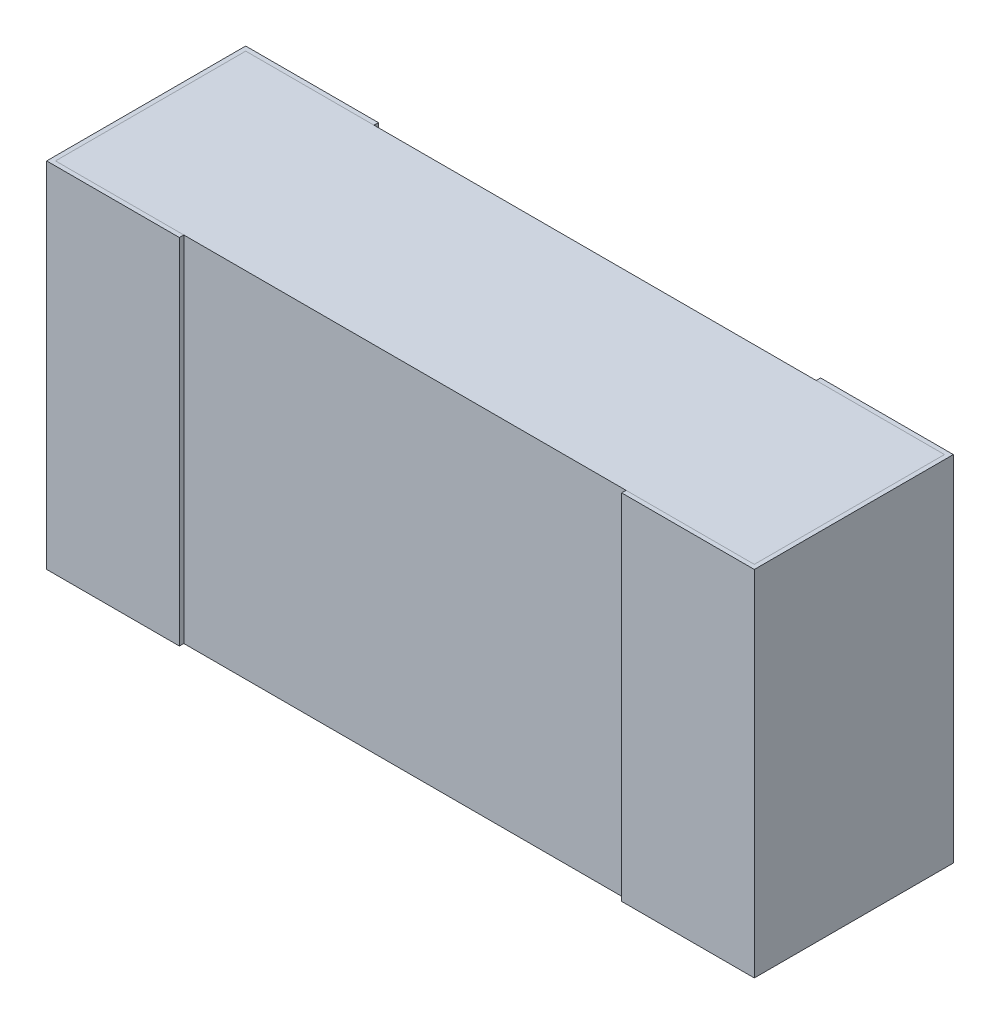
ISO-10303-21;
HEADER;
FILE_DESCRIPTION(('STEP AP214'),'2;1');
FILE_NAME('part.step','',(''),(''),'','','');
FILE_SCHEMA(('AUTOMOTIVE_DESIGN { 1 0 10303 214 1 1 1 1 }'));
ENDSEC;
DATA;
#1=APPLICATION_CONTEXT('core data for automotive mechanical design processes');
#2=APPLICATION_PROTOCOL_DEFINITION('international standard','automotive_design',2000,#1);
#3=PRODUCT_CONTEXT('',#1,'mechanical');
#4=PRODUCT('Part','Part','',(#3));
#5=PRODUCT_RELATED_PRODUCT_CATEGORY('part','',(#4));
#6=PRODUCT_DEFINITION_FORMATION('','',#4);
#7=PRODUCT_DEFINITION_CONTEXT('part definition',#1,'design');
#8=PRODUCT_DEFINITION('design','',#6,#7);
#9=PRODUCT_DEFINITION_SHAPE('','',#8);
#10=(LENGTH_UNIT() NAMED_UNIT(*) SI_UNIT(.MILLI.,.METRE.));
#11=(NAMED_UNIT(*) PLANE_ANGLE_UNIT() SI_UNIT($,.RADIAN.));
#12=(NAMED_UNIT(*) SI_UNIT($,.STERADIAN.) SOLID_ANGLE_UNIT());
#13=UNCERTAINTY_MEASURE_WITH_UNIT(LENGTH_MEASURE(1.E-05),#10,'distance_accuracy_value','');
#14=(GEOMETRIC_REPRESENTATION_CONTEXT(3) GLOBAL_UNCERTAINTY_ASSIGNED_CONTEXT((#13)) GLOBAL_UNIT_ASSIGNED_CONTEXT((#10,
#11,#12)) REPRESENTATION_CONTEXT('',''));
#15=CARTESIAN_POINT('',(0.,0.,0.));
#16=DIRECTION('',(0.,0.,1.));
#17=DIRECTION('',(1.,0.,0.));
#18=AXIS2_PLACEMENT_3D('',#15,#16,#17);
#19=CARTESIAN_POINT('',(0.79,2.03746755693052,-0.0216121610286598));
#20=DIRECTION('',(0.,0.,-1.));
#21=DIRECTION('',(-1.,0.,0.));
#22=AXIS2_PLACEMENT_3D('',#19,#20,#21);
#23=PLANE('',#22);
#24=DIRECTION('',(1.,0.,0.));
#25=VECTOR('',#24,1.);
#26=CARTESIAN_POINT('',(0.79,0.4,-0.0216121610286598));
#27=LINE('',#26,#25);
#28=CARTESIAN_POINT('',(-0.79,0.4,-0.0216121610286598));
#29=VERTEX_POINT('',#28);
#30=CARTESIAN_POINT('',(0.79,0.4,-0.0216121610286598));
#31=VERTEX_POINT('',#30);
#32=EDGE_CURVE('E111',#29,#31,#27,.T.);
#33=ORIENTED_EDGE('',*,*,#32,.F.);
#34=DIRECTION('',(0.,-1.,0.));
#35=VECTOR('',#34,1.);
#36=CARTESIAN_POINT('',(-0.79,2.03746755693052,-0.0216121610286598));
#37=LINE('',#36,#35);
#38=CARTESIAN_POINT('',(-0.79,-0.4,-0.0216121610286598));
#39=VERTEX_POINT('',#38);
#40=EDGE_CURVE('E49',#29,#39,#37,.T.);
#41=ORIENTED_EDGE('',*,*,#40,.T.);
#42=DIRECTION('',(-1.,0.,0.));
#43=VECTOR('',#42,1.);
#44=CARTESIAN_POINT('',(0.79,-0.4,-0.0216121610286598));
#45=LINE('',#44,#43);
#46=CARTESIAN_POINT('',(0.79,-0.4,-0.0216121610286598));
#47=VERTEX_POINT('',#46);
#48=EDGE_CURVE('E105',#47,#39,#45,.T.);
#49=ORIENTED_EDGE('',*,*,#48,.F.);
#50=DIRECTION('',(0.,-1.,0.));
#51=VECTOR('',#50,1.);
#52=CARTESIAN_POINT('',(0.79,2.03746755693052,-0.0216121610286598));
#53=LINE('',#52,#51);
#54=EDGE_CURVE('E94',#31,#47,#53,.T.);
#55=ORIENTED_EDGE('',*,*,#54,.F.);
#56=EDGE_LOOP('',(#33,#41,#49,#55));
#57=FACE_BOUND('',#56,.T.);
#58=ADVANCED_FACE('F45',(#57),#23,.F.);
#59=CARTESIAN_POINT('',(0.79,2.03746755693052,-0.0216121610286598));
#60=DIRECTION('',(-1.,0.,0.));
#61=DIRECTION('',(0.,0.,1.));
#62=AXIS2_PLACEMENT_3D('',#59,#60,#61);
#63=PLANE('',#62);
#64=DIRECTION('',(0.,0.,-1.));
#65=VECTOR('',#64,1.);
#66=CARTESIAN_POINT('',(0.79,0.4,-0.0216121610286598));
#67=LINE('',#66,#65);
#68=CARTESIAN_POINT('',(0.79,0.4,-0.45161216102866));
#69=VERTEX_POINT('',#68);
#70=EDGE_CURVE('E54',#31,#69,#67,.T.);
#71=ORIENTED_EDGE('',*,*,#70,.F.);
#72=ORIENTED_EDGE('',*,*,#54,.T.);
#73=DIRECTION('',(0.,0.,1.));
#74=VECTOR('',#73,1.);
#75=CARTESIAN_POINT('',(0.79,-0.4,-0.0216121610286598));
#76=LINE('',#75,#74);
#77=CARTESIAN_POINT('',(0.79,-0.4,-0.45161216102866));
#78=VERTEX_POINT('',#77);
#79=EDGE_CURVE('E100',#78,#47,#76,.T.);
#80=ORIENTED_EDGE('',*,*,#79,.F.);
#81=DIRECTION('',(0.,-1.,0.));
#82=VECTOR('',#81,1.);
#83=CARTESIAN_POINT('',(0.79,2.03746755693052,-0.45161216102866));
#84=LINE('',#83,#82);
#85=EDGE_CURVE('E89',#69,#78,#84,.T.);
#86=ORIENTED_EDGE('',*,*,#85,.F.);
#87=EDGE_LOOP('',(#71,#72,#80,#86));
#88=FACE_BOUND('',#87,.T.);
#89=ADVANCED_FACE('F104',(#88),#63,.F.);
#90=CARTESIAN_POINT('',(0.79,2.03746755693052,-0.45161216102866));
#91=DIRECTION('',(0.,0.,1.));
#92=DIRECTION('',(1.,0.,0.));
#93=AXIS2_PLACEMENT_3D('',#90,#91,#92);
#94=PLANE('',#93);
#95=DIRECTION('',(-1.,0.,0.));
#96=VECTOR('',#95,1.);
#97=CARTESIAN_POINT('',(0.79,0.4,-0.45161216102866));
#98=LINE('',#97,#96);
#99=CARTESIAN_POINT('',(-0.79,0.4,-0.45161216102866));
#100=VERTEX_POINT('',#99);
#101=EDGE_CURVE('E12',#69,#100,#98,.T.);
#102=ORIENTED_EDGE('',*,*,#101,.F.);
#103=ORIENTED_EDGE('',*,*,#85,.T.);
#104=DIRECTION('',(1.,0.,0.));
#105=VECTOR('',#104,1.);
#106=CARTESIAN_POINT('',(0.79,-0.4,-0.45161216102866));
#107=LINE('',#106,#105);
#108=CARTESIAN_POINT('',(-0.79,-0.4,-0.45161216102866));
#109=VERTEX_POINT('',#108);
#110=EDGE_CURVE('E92',#109,#78,#107,.T.);
#111=ORIENTED_EDGE('',*,*,#110,.F.);
#112=DIRECTION('',(0.,-1.,0.));
#113=VECTOR('',#112,1.);
#114=CARTESIAN_POINT('',(-0.79,2.03746755693052,-0.45161216102866));
#115=LINE('',#114,#113);
#116=EDGE_CURVE('E70',#100,#109,#115,.T.);
#117=ORIENTED_EDGE('',*,*,#116,.F.);
#118=EDGE_LOOP('',(#102,#103,#111,#117));
#119=FACE_BOUND('',#118,.T.);
#120=ADVANCED_FACE('F91',(#119),#94,.F.);
#121=CARTESIAN_POINT('',(-0.79,2.03746755693052,-0.0216121610286598));
#122=DIRECTION('',(1.,0.,0.));
#123=DIRECTION('',(0.,0.,-1.));
#124=AXIS2_PLACEMENT_3D('',#121,#122,#123);
#125=PLANE('',#124);
#126=DIRECTION('',(0.,0.,1.));
#127=VECTOR('',#126,1.);
#128=CARTESIAN_POINT('',(-0.79,0.4,-0.0216121610286598));
#129=LINE('',#128,#127);
#130=EDGE_CURVE('E114',#100,#29,#129,.T.);
#131=ORIENTED_EDGE('',*,*,#130,.F.);
#132=ORIENTED_EDGE('',*,*,#116,.T.);
#133=DIRECTION('',(0.,0.,-1.));
#134=VECTOR('',#133,1.);
#135=CARTESIAN_POINT('',(-0.79,-0.4,-0.0216121610286598));
#136=LINE('',#135,#134);
#137=EDGE_CURVE('E102',#39,#109,#136,.T.);
#138=ORIENTED_EDGE('',*,*,#137,.F.);
#139=ORIENTED_EDGE('',*,*,#40,.F.);
#140=EDGE_LOOP('',(#131,#132,#138,#139));
#141=FACE_BOUND('',#140,.T.);
#142=ADVANCED_FACE('F118',(#141),#125,.F.);
#143=CARTESIAN_POINT('',(0.8,0.4,-0.0116121610286598));
#144=DIRECTION('',(0.,1.,0.));
#145=DIRECTION('',(0.,0.,1.));
#146=AXIS2_PLACEMENT_3D('',#143,#144,#145);
#147=PLANE('',#146);
#148=ORIENTED_EDGE('',*,*,#130,.T.);
#149=ORIENTED_EDGE('',*,*,#32,.T.);
#150=ORIENTED_EDGE('',*,*,#70,.T.);
#151=ORIENTED_EDGE('',*,*,#101,.T.);
#152=EDGE_LOOP('',(#148,#149,#150,#151));
#153=FACE_BOUND('',#152,.T.);
#154=ADVANCED_FACE('F47',(#153),#147,.T.);
#155=CARTESIAN_POINT('',(0.8,-0.4,-0.0116121610286598));
#156=DIRECTION('',(0.,1.,0.));
#157=DIRECTION('',(0.,0.,1.));
#158=AXIS2_PLACEMENT_3D('',#155,#156,#157);
#159=PLANE('',#158);
#160=ORIENTED_EDGE('',*,*,#48,.T.);
#161=ORIENTED_EDGE('',*,*,#137,.T.);
#162=ORIENTED_EDGE('',*,*,#110,.T.);
#163=ORIENTED_EDGE('',*,*,#79,.T.);
#164=EDGE_LOOP('',(#160,#161,#162,#163));
#165=FACE_BOUND('',#164,.T.);
#166=ADVANCED_FACE('F99',(#165),#159,.F.);
#167=CLOSED_SHELL('',(#58,#89,#120,#142,#154,#166));
#168=MANIFOLD_SOLID_BREP('B2',#167);
#169=CARTESIAN_POINT('',(-0.5,0.4,-0.0116121610286598));
#170=DIRECTION('',(-1.,0.,0.));
#171=DIRECTION('',(0.,0.,1.));
#172=AXIS2_PLACEMENT_3D('',#169,#170,#171);
#173=PLANE('',#172);
#174=DIRECTION('',(0.,0.,-1.));
#175=VECTOR('',#174,1.);
#176=CARTESIAN_POINT('',(-0.5,-0.4,-0.0116121610286598));
#177=LINE('',#176,#175);
#178=CARTESIAN_POINT('',(-0.5,-0.4,-0.0116121610286598));
#179=VERTEX_POINT('',#178);
#180=CARTESIAN_POINT('',(-0.5,-0.4,-0.0216121610286598));
#181=VERTEX_POINT('',#180);
#182=EDGE_CURVE('E273',#179,#181,#177,.T.);
#183=ORIENTED_EDGE('',*,*,#182,.T.);
#184=DIRECTION('',(0.,-1.,0.));
#185=VECTOR('',#184,1.);
#186=CARTESIAN_POINT('',(-0.5,0.4,-0.0216121610286598));
#187=LINE('',#186,#185);
#188=CARTESIAN_POINT('',(-0.5,0.4,-0.0216121610286598));
#189=VERTEX_POINT('',#188);
#190=EDGE_CURVE('E43',#189,#181,#187,.T.);
#191=ORIENTED_EDGE('',*,*,#190,.F.);
#192=DIRECTION('',(0.,0.,-1.));
#193=VECTOR('',#192,1.);
#194=CARTESIAN_POINT('',(-0.5,0.4,-0.0116121610286598));
#195=LINE('',#194,#193);
#196=CARTESIAN_POINT('',(-0.5,0.4,-0.0116121610286598));
#197=VERTEX_POINT('',#196);
#198=EDGE_CURVE('E287',#197,#189,#195,.T.);
#199=ORIENTED_EDGE('',*,*,#198,.F.);
#200=DIRECTION('',(0.,-1.,0.));
#201=VECTOR('',#200,1.);
#202=CARTESIAN_POINT('',(-0.5,0.4,-0.0116121610286598));
#203=LINE('',#202,#201);
#204=EDGE_CURVE('E269',#197,#179,#203,.T.);
#205=ORIENTED_EDGE('',*,*,#204,.T.);
#206=EDGE_LOOP('',(#183,#191,#199,#205));
#207=FACE_BOUND('',#206,.T.);
#208=ADVANCED_FACE('F177',(#207),#173,.F.);
#209=CARTESIAN_POINT('',(-0.5,0.4,-0.0216121610286598));
#210=DIRECTION('',(0.,0.,1.));
#211=DIRECTION('',(1.,0.,0.));
#212=AXIS2_PLACEMENT_3D('',#209,#210,#211);
#213=PLANE('',#212);
#214=DIRECTION('',(-1.,0.,0.));
#215=VECTOR('',#214,1.);
#216=CARTESIAN_POINT('',(-0.5,-0.4,-0.0216121610286598));
#217=LINE('',#216,#215);
#218=CARTESIAN_POINT('',(-0.79,-0.4,-0.0216121610286598));
#219=VERTEX_POINT('',#218);
#220=EDGE_CURVE('E276',#181,#219,#217,.T.);
#221=ORIENTED_EDGE('',*,*,#220,.T.);
#222=DIRECTION('',(0.,-1.,0.));
#223=VECTOR('',#222,1.);
#224=CARTESIAN_POINT('',(-0.79,0.4,-0.0216121610286598));
#225=LINE('',#224,#223);
#226=CARTESIAN_POINT('',(-0.79,0.4,-0.0216121610286598));
#227=VERTEX_POINT('',#226);
#228=EDGE_CURVE('E185',#227,#219,#225,.T.);
#229=ORIENTED_EDGE('',*,*,#228,.F.);
#230=DIRECTION('',(-1.,0.,0.));
#231=VECTOR('',#230,1.);
#232=CARTESIAN_POINT('',(-0.5,0.4,-0.0216121610286598));
#233=LINE('',#232,#231);
#234=EDGE_CURVE('E236',#189,#227,#233,.T.);
#235=ORIENTED_EDGE('',*,*,#234,.F.);
#236=ORIENTED_EDGE('',*,*,#190,.T.);
#237=EDGE_LOOP('',(#221,#229,#235,#236));
#238=FACE_BOUND('',#237,.T.);
#239=ADVANCED_FACE('F322',(#238),#213,.F.);
#240=CARTESIAN_POINT('',(-0.79,0.4,-0.0216121610286598));
#241=DIRECTION('',(-1.,0.,0.));
#242=DIRECTION('',(0.,0.,1.));
#243=AXIS2_PLACEMENT_3D('',#240,#241,#242);
#244=PLANE('',#243);
#245=DIRECTION('',(0.,0.,-1.));
#246=VECTOR('',#245,1.);
#247=CARTESIAN_POINT('',(-0.79,-0.4,-0.0216121610286598));
#248=LINE('',#247,#246);
#249=CARTESIAN_POINT('',(-0.79,-0.4,-0.45161216102866));
#250=VERTEX_POINT('',#249);
#251=EDGE_CURVE('E278',#219,#250,#248,.T.);
#252=ORIENTED_EDGE('',*,*,#251,.T.);
#253=DIRECTION('',(0.,-1.,0.));
#254=VECTOR('',#253,1.);
#255=CARTESIAN_POINT('',(-0.79,0.4,-0.45161216102866));
#256=LINE('',#255,#254);
#257=CARTESIAN_POINT('',(-0.79,0.4,-0.45161216102866));
#258=VERTEX_POINT('',#257);
#259=EDGE_CURVE('E294',#258,#250,#256,.T.);
#260=ORIENTED_EDGE('',*,*,#259,.F.);
#261=DIRECTION('',(0.,0.,-1.));
#262=VECTOR('',#261,1.);
#263=CARTESIAN_POINT('',(-0.79,0.4,-0.0216121610286598));
#264=LINE('',#263,#262);
#265=EDGE_CURVE('E302',#227,#258,#264,.T.);
#266=ORIENTED_EDGE('',*,*,#265,.F.);
#267=ORIENTED_EDGE('',*,*,#228,.T.);
#268=EDGE_LOOP('',(#252,#260,#266,#267));
#269=FACE_BOUND('',#268,.T.);
#270=ADVANCED_FACE('F300',(#269),#244,.F.);
#271=CARTESIAN_POINT('',(-0.79,0.4,-0.45161216102866));
#272=DIRECTION('',(0.,0.,-1.));
#273=DIRECTION('',(-1.,0.,0.));
#274=AXIS2_PLACEMENT_3D('',#271,#272,#273);
#275=PLANE('',#274);
#276=DIRECTION('',(1.,0.,0.));
#277=VECTOR('',#276,1.);
#278=CARTESIAN_POINT('',(-0.79,-0.4,-0.45161216102866));
#279=LINE('',#278,#277);
#280=CARTESIAN_POINT('',(-0.5,-0.4,-0.45161216102866));
#281=VERTEX_POINT('',#280);
#282=EDGE_CURVE('E280',#250,#281,#279,.T.);
#283=ORIENTED_EDGE('',*,*,#282,.T.);
#284=DIRECTION('',(0.,-1.,0.));
#285=VECTOR('',#284,1.);
#286=CARTESIAN_POINT('',(-0.5,0.4,-0.45161216102866));
#287=LINE('',#286,#285);
#288=CARTESIAN_POINT('',(-0.5,0.4,-0.45161216102866));
#289=VERTEX_POINT('',#288);
#290=EDGE_CURVE('E291',#289,#281,#287,.T.);
#291=ORIENTED_EDGE('',*,*,#290,.F.);
#292=DIRECTION('',(1.,0.,0.));
#293=VECTOR('',#292,1.);
#294=CARTESIAN_POINT('',(-0.79,0.4,-0.45161216102866));
#295=LINE('',#294,#293);
#296=EDGE_CURVE('E314',#258,#289,#295,.T.);
#297=ORIENTED_EDGE('',*,*,#296,.F.);
#298=ORIENTED_EDGE('',*,*,#259,.T.);
#299=EDGE_LOOP('',(#283,#291,#297,#298));
#300=FACE_BOUND('',#299,.T.);
#301=ADVANCED_FACE('F310',(#300),#275,.F.);
#302=CARTESIAN_POINT('',(-0.5,0.4,-0.45161216102866));
#303=DIRECTION('',(-1.,0.,0.));
#304=DIRECTION('',(0.,0.,1.));
#305=AXIS2_PLACEMENT_3D('',#302,#303,#304);
#306=PLANE('',#305);
#307=DIRECTION('',(0.,0.,-1.));
#308=VECTOR('',#307,1.);
#309=CARTESIAN_POINT('',(-0.5,-0.4,-0.45161216102866));
#310=LINE('',#309,#308);
#311=CARTESIAN_POINT('',(-0.5,-0.4,-0.46161216102866));
#312=VERTEX_POINT('',#311);
#313=EDGE_CURVE('E282',#281,#312,#310,.T.);
#314=ORIENTED_EDGE('',*,*,#313,.T.);
#315=DIRECTION('',(0.,-1.,0.));
#316=VECTOR('',#315,1.);
#317=CARTESIAN_POINT('',(-0.5,0.4,-0.46161216102866));
#318=LINE('',#317,#316);
#319=CARTESIAN_POINT('',(-0.5,0.4,-0.46161216102866));
#320=VERTEX_POINT('',#319);
#321=EDGE_CURVE('E264',#320,#312,#318,.T.);
#322=ORIENTED_EDGE('',*,*,#321,.F.);
#323=DIRECTION('',(0.,0.,-1.));
#324=VECTOR('',#323,1.);
#325=CARTESIAN_POINT('',(-0.5,0.4,-0.45161216102866));
#326=LINE('',#325,#324);
#327=EDGE_CURVE('E255',#289,#320,#326,.T.);
#328=ORIENTED_EDGE('',*,*,#327,.F.);
#329=ORIENTED_EDGE('',*,*,#290,.T.);
#330=EDGE_LOOP('',(#314,#322,#328,#329));
#331=FACE_BOUND('',#330,.T.);
#332=ADVANCED_FACE('F313',(#331),#306,.F.);
#333=CARTESIAN_POINT('',(-0.8,0.4,-0.46161216102866));
#334=DIRECTION('',(0.,0.,1.));
#335=DIRECTION('',(1.,0.,0.));
#336=AXIS2_PLACEMENT_3D('',#333,#334,#335);
#337=PLANE('',#336);
#338=DIRECTION('',(-1.,0.,0.));
#339=VECTOR('',#338,1.);
#340=CARTESIAN_POINT('',(-0.8,-0.4,-0.46161216102866));
#341=LINE('',#340,#339);
#342=CARTESIAN_POINT('',(-0.8,-0.4,-0.46161216102866));
#343=VERTEX_POINT('',#342);
#344=EDGE_CURVE('E263',#312,#343,#341,.T.);
#345=ORIENTED_EDGE('',*,*,#344,.T.);
#346=DIRECTION('',(0.,-1.,0.));
#347=VECTOR('',#346,1.);
#348=CARTESIAN_POINT('',(-0.8,0.4,-0.46161216102866));
#349=LINE('',#348,#347);
#350=CARTESIAN_POINT('',(-0.8,0.4,-0.46161216102866));
#351=VERTEX_POINT('',#350);
#352=EDGE_CURVE('E260',#351,#343,#349,.T.);
#353=ORIENTED_EDGE('',*,*,#352,.F.);
#354=DIRECTION('',(-1.,0.,0.));
#355=VECTOR('',#354,1.);
#356=CARTESIAN_POINT('',(-0.8,0.4,-0.46161216102866));
#357=LINE('',#356,#355);
#358=EDGE_CURVE('E249',#320,#351,#357,.T.);
#359=ORIENTED_EDGE('',*,*,#358,.F.);
#360=ORIENTED_EDGE('',*,*,#321,.T.);
#361=EDGE_LOOP('',(#345,#353,#359,#360));
#362=FACE_BOUND('',#361,.T.);
#363=ADVANCED_FACE('F261',(#362),#337,.F.);
#364=CARTESIAN_POINT('',(-0.8,0.4,-0.0116121610286598));
#365=DIRECTION('',(1.,0.,0.));
#366=DIRECTION('',(0.,0.,-1.));
#367=AXIS2_PLACEMENT_3D('',#364,#365,#366);
#368=PLANE('',#367);
#369=DIRECTION('',(0.,0.,1.));
#370=VECTOR('',#369,1.);
#371=CARTESIAN_POINT('',(-0.8,-0.4,-0.0116121610286598));
#372=LINE('',#371,#370);
#373=CARTESIAN_POINT('',(-0.8,-0.4,-0.0116121610286598));
#374=VERTEX_POINT('',#373);
#375=EDGE_CURVE('E222',#343,#374,#372,.T.);
#376=ORIENTED_EDGE('',*,*,#375,.T.);
#377=DIRECTION('',(0.,-1.,0.));
#378=VECTOR('',#377,1.);
#379=CARTESIAN_POINT('',(-0.8,0.4,-0.0116121610286598));
#380=LINE('',#379,#378);
#381=CARTESIAN_POINT('',(-0.8,0.4,-0.0116121610286598));
#382=VERTEX_POINT('',#381);
#383=EDGE_CURVE('E265',#382,#374,#380,.T.);
#384=ORIENTED_EDGE('',*,*,#383,.F.);
#385=DIRECTION('',(0.,0.,1.));
#386=VECTOR('',#385,1.);
#387=CARTESIAN_POINT('',(-0.8,0.4,-0.0116121610286598));
#388=LINE('',#387,#386);
#389=EDGE_CURVE('E253',#351,#382,#388,.T.);
#390=ORIENTED_EDGE('',*,*,#389,.F.);
#391=ORIENTED_EDGE('',*,*,#352,.T.);
#392=EDGE_LOOP('',(#376,#384,#390,#391));
#393=FACE_BOUND('',#392,.T.);
#394=ADVANCED_FACE('F267',(#393),#368,.F.);
#395=CARTESIAN_POINT('',(-0.5,0.4,-0.0116121610286598));
#396=DIRECTION('',(0.,0.,-1.));
#397=DIRECTION('',(-1.,0.,0.));
#398=AXIS2_PLACEMENT_3D('',#395,#396,#397);
#399=PLANE('',#398);
#400=DIRECTION('',(1.,0.,0.));
#401=VECTOR('',#400,1.);
#402=CARTESIAN_POINT('',(-0.5,-0.4,-0.0116121610286598));
#403=LINE('',#402,#401);
#404=EDGE_CURVE('E228',#374,#179,#403,.T.);
#405=ORIENTED_EDGE('',*,*,#404,.T.);
#406=ORIENTED_EDGE('',*,*,#204,.F.);
#407=DIRECTION('',(1.,0.,0.));
#408=VECTOR('',#407,1.);
#409=CARTESIAN_POINT('',(-0.5,0.4,-0.0116121610286598));
#410=LINE('',#409,#408);
#411=EDGE_CURVE('E193',#382,#197,#410,.T.);
#412=ORIENTED_EDGE('',*,*,#411,.F.);
#413=ORIENTED_EDGE('',*,*,#383,.T.);
#414=EDGE_LOOP('',(#405,#406,#412,#413));
#415=FACE_BOUND('',#414,.T.);
#416=ADVANCED_FACE('F338',(#415),#399,.F.);
#417=CARTESIAN_POINT('',(-0.5,0.4,-0.0216121610286598));
#418=DIRECTION('',(0.,1.,0.));
#419=DIRECTION('',(0.,0.,1.));
#420=AXIS2_PLACEMENT_3D('',#417,#418,#419);
#421=PLANE('',#420);
#422=ORIENTED_EDGE('',*,*,#198,.T.);
#423=ORIENTED_EDGE('',*,*,#234,.T.);
#424=ORIENTED_EDGE('',*,*,#265,.T.);
#425=ORIENTED_EDGE('',*,*,#296,.T.);
#426=ORIENTED_EDGE('',*,*,#327,.T.);
#427=ORIENTED_EDGE('',*,*,#358,.T.);
#428=ORIENTED_EDGE('',*,*,#389,.T.);
#429=ORIENTED_EDGE('',*,*,#411,.T.);
#430=EDGE_LOOP('',(#422,#423,#424,#425,#426,#427,#428,#429));
#431=FACE_BOUND('',#430,.T.);
#432=ADVANCED_FACE('F251',(#431),#421,.T.);
#433=CARTESIAN_POINT('',(-0.5,-0.4,-0.0216121610286598));
#434=DIRECTION('',(0.,1.,0.));
#435=DIRECTION('',(0.,0.,1.));
#436=AXIS2_PLACEMENT_3D('',#433,#434,#435);
#437=PLANE('',#436);
#438=ORIENTED_EDGE('',*,*,#182,.F.);
#439=ORIENTED_EDGE('',*,*,#404,.F.);
#440=ORIENTED_EDGE('',*,*,#375,.F.);
#441=ORIENTED_EDGE('',*,*,#344,.F.);
#442=ORIENTED_EDGE('',*,*,#313,.F.);
#443=ORIENTED_EDGE('',*,*,#282,.F.);
#444=ORIENTED_EDGE('',*,*,#251,.F.);
#445=ORIENTED_EDGE('',*,*,#220,.F.);
#446=EDGE_LOOP('',(#438,#439,#440,#441,#442,#443,#444,#445));
#447=FACE_BOUND('',#446,.T.);
#448=ADVANCED_FACE('F306',(#447),#437,.F.);
#449=CLOSED_SHELL('',(#208,#239,#270,#301,#332,#363,#394,#416,#432,#448));
#450=MANIFOLD_SOLID_BREP('B6',#449);
#451=CARTESIAN_POINT('',(0.5,0.4,-0.0116121610286598));
#452=DIRECTION('',(0.,0.,-1.));
#453=DIRECTION('',(-1.,0.,0.));
#454=AXIS2_PLACEMENT_3D('',#451,#452,#453);
#455=PLANE('',#454);
#456=DIRECTION('',(1.,0.,0.));
#457=VECTOR('',#456,1.);
#458=CARTESIAN_POINT('',(0.5,-0.4,-0.0116121610286598));
#459=LINE('',#458,#457);
#460=CARTESIAN_POINT('',(0.5,-0.4,-0.0116121610286598));
#461=VERTEX_POINT('',#460);
#462=CARTESIAN_POINT('',(0.8,-0.4,-0.0116121610286598));
#463=VERTEX_POINT('',#462);
#464=EDGE_CURVE('E500',#461,#463,#459,.T.);
#465=ORIENTED_EDGE('',*,*,#464,.T.);
#466=DIRECTION('',(0.,-1.,0.));
#467=VECTOR('',#466,1.);
#468=CARTESIAN_POINT('',(0.8,0.4,-0.0116121610286598));
#469=LINE('',#468,#467);
#470=CARTESIAN_POINT('',(0.8,0.4,-0.0116121610286598));
#471=VERTEX_POINT('',#470);
#472=EDGE_CURVE('E175',#471,#463,#469,.T.);
#473=ORIENTED_EDGE('',*,*,#472,.F.);
#474=DIRECTION('',(1.,0.,0.));
#475=VECTOR('',#474,1.);
#476=CARTESIAN_POINT('',(0.5,0.4,-0.0116121610286598));
#477=LINE('',#476,#475);
#478=CARTESIAN_POINT('',(0.5,0.4,-0.0116121610286598));
#479=VERTEX_POINT('',#478);
#480=EDGE_CURVE('E514',#479,#471,#477,.T.);
#481=ORIENTED_EDGE('',*,*,#480,.F.);
#482=DIRECTION('',(0.,-1.,0.));
#483=VECTOR('',#482,1.);
#484=CARTESIAN_POINT('',(0.5,0.4,-0.0116121610286598));
#485=LINE('',#484,#483);
#486=EDGE_CURVE('E496',#479,#461,#485,.T.);
#487=ORIENTED_EDGE('',*,*,#486,.T.);
#488=EDGE_LOOP('',(#465,#473,#481,#487));
#489=FACE_BOUND('',#488,.T.);
#490=ADVANCED_FACE('F404',(#489),#455,.F.);
#491=CARTESIAN_POINT('',(0.8,0.4,-0.0116121610286598));
#492=DIRECTION('',(-1.,0.,0.));
#493=DIRECTION('',(0.,0.,1.));
#494=AXIS2_PLACEMENT_3D('',#491,#492,#493);
#495=PLANE('',#494);
#496=DIRECTION('',(0.,0.,-1.));
#497=VECTOR('',#496,1.);
#498=CARTESIAN_POINT('',(0.8,-0.4,-0.0116121610286598));
#499=LINE('',#498,#497);
#500=CARTESIAN_POINT('',(0.8,-0.4,-0.46161216102866));
#501=VERTEX_POINT('',#500);
#502=EDGE_CURVE('E503',#463,#501,#499,.T.);
#503=ORIENTED_EDGE('',*,*,#502,.T.);
#504=DIRECTION('',(0.,-1.,0.));
#505=VECTOR('',#504,1.);
#506=CARTESIAN_POINT('',(0.8,0.4,-0.46161216102866));
#507=LINE('',#506,#505);
#508=CARTESIAN_POINT('',(0.8,0.4,-0.46161216102866));
#509=VERTEX_POINT('',#508);
#510=EDGE_CURVE('E412',#509,#501,#507,.T.);
#511=ORIENTED_EDGE('',*,*,#510,.F.);
#512=DIRECTION('',(0.,0.,-1.));
#513=VECTOR('',#512,1.);
#514=CARTESIAN_POINT('',(0.8,0.4,-0.0116121610286598));
#515=LINE('',#514,#513);
#516=EDGE_CURVE('E463',#471,#509,#515,.T.);
#517=ORIENTED_EDGE('',*,*,#516,.F.);
#518=ORIENTED_EDGE('',*,*,#472,.T.);
#519=EDGE_LOOP('',(#503,#511,#517,#518));
#520=FACE_BOUND('',#519,.T.);
#521=ADVANCED_FACE('F549',(#520),#495,.F.);
#522=CARTESIAN_POINT('',(0.8,0.4,-0.46161216102866));
#523=DIRECTION('',(0.,0.,1.));
#524=DIRECTION('',(1.,0.,0.));
#525=AXIS2_PLACEMENT_3D('',#522,#523,#524);
#526=PLANE('',#525);
#527=DIRECTION('',(-1.,0.,0.));
#528=VECTOR('',#527,1.);
#529=CARTESIAN_POINT('',(0.8,-0.4,-0.46161216102866));
#530=LINE('',#529,#528);
#531=CARTESIAN_POINT('',(0.5,-0.4,-0.46161216102866));
#532=VERTEX_POINT('',#531);
#533=EDGE_CURVE('E505',#501,#532,#530,.T.);
#534=ORIENTED_EDGE('',*,*,#533,.T.);
#535=DIRECTION('',(0.,-1.,0.));
#536=VECTOR('',#535,1.);
#537=CARTESIAN_POINT('',(0.5,0.4,-0.46161216102866));
#538=LINE('',#537,#536);
#539=CARTESIAN_POINT('',(0.5,0.4,-0.46161216102866));
#540=VERTEX_POINT('',#539);
#541=EDGE_CURVE('E521',#540,#532,#538,.T.);
#542=ORIENTED_EDGE('',*,*,#541,.F.);
#543=DIRECTION('',(-1.,0.,0.));
#544=VECTOR('',#543,1.);
#545=CARTESIAN_POINT('',(0.8,0.4,-0.46161216102866));
#546=LINE('',#545,#544);
#547=EDGE_CURVE('E529',#509,#540,#546,.T.);
#548=ORIENTED_EDGE('',*,*,#547,.F.);
#549=ORIENTED_EDGE('',*,*,#510,.T.);
#550=EDGE_LOOP('',(#534,#542,#548,#549));
#551=FACE_BOUND('',#550,.T.);
#552=ADVANCED_FACE('F527',(#551),#526,.F.);
#553=CARTESIAN_POINT('',(0.5,0.4,-0.45161216102866));
#554=DIRECTION('',(1.,0.,0.));
#555=DIRECTION('',(0.,0.,-1.));
#556=AXIS2_PLACEMENT_3D('',#553,#554,#555);
#557=PLANE('',#556);
#558=DIRECTION('',(0.,0.,1.));
#559=VECTOR('',#558,1.);
#560=CARTESIAN_POINT('',(0.5,-0.4,-0.45161216102866));
#561=LINE('',#560,#559);
#562=CARTESIAN_POINT('',(0.5,-0.4,-0.45161216102866));
#563=VERTEX_POINT('',#562);
#564=EDGE_CURVE('E507',#532,#563,#561,.T.);
#565=ORIENTED_EDGE('',*,*,#564,.T.);
#566=DIRECTION('',(0.,-1.,0.));
#567=VECTOR('',#566,1.);
#568=CARTESIAN_POINT('',(0.5,0.4,-0.45161216102866));
#569=LINE('',#568,#567);
#570=CARTESIAN_POINT('',(0.5,0.4,-0.45161216102866));
#571=VERTEX_POINT('',#570);
#572=EDGE_CURVE('E518',#571,#563,#569,.T.);
#573=ORIENTED_EDGE('',*,*,#572,.F.);
#574=DIRECTION('',(0.,0.,1.));
#575=VECTOR('',#574,1.);
#576=CARTESIAN_POINT('',(0.5,0.4,-0.45161216102866));
#577=LINE('',#576,#575);
#578=EDGE_CURVE('E541',#540,#571,#577,.T.);
#579=ORIENTED_EDGE('',*,*,#578,.F.);
#580=ORIENTED_EDGE('',*,*,#541,.T.);
#581=EDGE_LOOP('',(#565,#573,#579,#580));
#582=FACE_BOUND('',#581,.T.);
#583=ADVANCED_FACE('F537',(#582),#557,.F.);
#584=CARTESIAN_POINT('',(0.79,0.4,-0.45161216102866));
#585=DIRECTION('',(0.,0.,-1.));
#586=DIRECTION('',(-1.,0.,0.));
#587=AXIS2_PLACEMENT_3D('',#584,#585,#586);
#588=PLANE('',#587);
#589=DIRECTION('',(1.,0.,0.));
#590=VECTOR('',#589,1.);
#591=CARTESIAN_POINT('',(0.79,-0.4,-0.45161216102866));
#592=LINE('',#591,#590);
#593=CARTESIAN_POINT('',(0.79,-0.4,-0.45161216102866));
#594=VERTEX_POINT('',#593);
#595=EDGE_CURVE('E509',#563,#594,#592,.T.);
#596=ORIENTED_EDGE('',*,*,#595,.T.);
#597=DIRECTION('',(0.,-1.,0.));
#598=VECTOR('',#597,1.);
#599=CARTESIAN_POINT('',(0.79,0.4,-0.45161216102866));
#600=LINE('',#599,#598);
#601=CARTESIAN_POINT('',(0.79,0.4,-0.45161216102866));
#602=VERTEX_POINT('',#601);
#603=EDGE_CURVE('E491',#602,#594,#600,.T.);
#604=ORIENTED_EDGE('',*,*,#603,.F.);
#605=DIRECTION('',(1.,0.,0.));
#606=VECTOR('',#605,1.);
#607=CARTESIAN_POINT('',(0.79,0.4,-0.45161216102866));
#608=LINE('',#607,#606);
#609=EDGE_CURVE('E482',#571,#602,#608,.T.);
#610=ORIENTED_EDGE('',*,*,#609,.F.);
#611=ORIENTED_EDGE('',*,*,#572,.T.);
#612=EDGE_LOOP('',(#596,#604,#610,#611));
#613=FACE_BOUND('',#612,.T.);
#614=ADVANCED_FACE('F540',(#613),#588,.F.);
#615=CARTESIAN_POINT('',(0.79,0.4,-0.0216121610286598));
#616=DIRECTION('',(1.,0.,0.));
#617=DIRECTION('',(0.,0.,-1.));
#618=AXIS2_PLACEMENT_3D('',#615,#616,#617);
#619=PLANE('',#618);
#620=DIRECTION('',(0.,0.,1.));
#621=VECTOR('',#620,1.);
#622=CARTESIAN_POINT('',(0.79,-0.4,-0.0216121610286598));
#623=LINE('',#622,#621);
#624=CARTESIAN_POINT('',(0.79,-0.4,-0.0216121610286598));
#625=VERTEX_POINT('',#624);
#626=EDGE_CURVE('E490',#594,#625,#623,.T.);
#627=ORIENTED_EDGE('',*,*,#626,.T.);
#628=DIRECTION('',(0.,-1.,0.));
#629=VECTOR('',#628,1.);
#630=CARTESIAN_POINT('',(0.79,0.4,-0.0216121610286598));
#631=LINE('',#630,#629);
#632=CARTESIAN_POINT('',(0.79,0.4,-0.0216121610286598));
#633=VERTEX_POINT('',#632);
#634=EDGE_CURVE('E487',#633,#625,#631,.T.);
#635=ORIENTED_EDGE('',*,*,#634,.F.);
#636=DIRECTION('',(0.,0.,1.));
#637=VECTOR('',#636,1.);
#638=CARTESIAN_POINT('',(0.79,0.4,-0.0216121610286598));
#639=LINE('',#638,#637);
#640=EDGE_CURVE('E476',#602,#633,#639,.T.);
#641=ORIENTED_EDGE('',*,*,#640,.F.);
#642=ORIENTED_EDGE('',*,*,#603,.T.);
#643=EDGE_LOOP('',(#627,#635,#641,#642));
#644=FACE_BOUND('',#643,.T.);
#645=ADVANCED_FACE('F488',(#644),#619,.F.);
#646=CARTESIAN_POINT('',(0.5,0.4,-0.0216121610286598));
#647=DIRECTION('',(0.,0.,1.));
#648=DIRECTION('',(1.,0.,0.));
#649=AXIS2_PLACEMENT_3D('',#646,#647,#648);
#650=PLANE('',#649);
#651=DIRECTION('',(-1.,0.,0.));
#652=VECTOR('',#651,1.);
#653=CARTESIAN_POINT('',(0.5,-0.4,-0.0216121610286598));
#654=LINE('',#653,#652);
#655=CARTESIAN_POINT('',(0.5,-0.4,-0.0216121610286598));
#656=VERTEX_POINT('',#655);
#657=EDGE_CURVE('E449',#625,#656,#654,.T.);
#658=ORIENTED_EDGE('',*,*,#657,.T.);
#659=DIRECTION('',(0.,-1.,0.));
#660=VECTOR('',#659,1.);
#661=CARTESIAN_POINT('',(0.5,0.4,-0.0216121610286598));
#662=LINE('',#661,#660);
#663=CARTESIAN_POINT('',(0.5,0.4,-0.0216121610286598));
#664=VERTEX_POINT('',#663);
#665=EDGE_CURVE('E492',#664,#656,#662,.T.);
#666=ORIENTED_EDGE('',*,*,#665,.F.);
#667=DIRECTION('',(-1.,0.,0.));
#668=VECTOR('',#667,1.);
#669=CARTESIAN_POINT('',(0.5,0.4,-0.0216121610286598));
#670=LINE('',#669,#668);
#671=EDGE_CURVE('E480',#633,#664,#670,.T.);
#672=ORIENTED_EDGE('',*,*,#671,.F.);
#673=ORIENTED_EDGE('',*,*,#634,.T.);
#674=EDGE_LOOP('',(#658,#666,#672,#673));
#675=FACE_BOUND('',#674,.T.);
#676=ADVANCED_FACE('F494',(#675),#650,.F.);
#677=CARTESIAN_POINT('',(0.5,0.4,-0.0116121610286598));
#678=DIRECTION('',(1.,0.,0.));
#679=DIRECTION('',(0.,0.,-1.));
#680=AXIS2_PLACEMENT_3D('',#677,#678,#679);
#681=PLANE('',#680);
#682=DIRECTION('',(0.,0.,1.));
#683=VECTOR('',#682,1.);
#684=CARTESIAN_POINT('',(0.5,-0.4,-0.0116121610286598));
#685=LINE('',#684,#683);
#686=EDGE_CURVE('E455',#656,#461,#685,.T.);
#687=ORIENTED_EDGE('',*,*,#686,.T.);
#688=ORIENTED_EDGE('',*,*,#486,.F.);
#689=DIRECTION('',(0.,0.,1.));
#690=VECTOR('',#689,1.);
#691=CARTESIAN_POINT('',(0.5,0.4,-0.0116121610286598));
#692=LINE('',#691,#690);
#693=EDGE_CURVE('E420',#664,#479,#692,.T.);
#694=ORIENTED_EDGE('',*,*,#693,.F.);
#695=ORIENTED_EDGE('',*,*,#665,.T.);
#696=EDGE_LOOP('',(#687,#688,#694,#695));
#697=FACE_BOUND('',#696,.T.);
#698=ADVANCED_FACE('F565',(#697),#681,.F.);
#699=CARTESIAN_POINT('',(0.8,0.4,-0.0116121610286598));
#700=DIRECTION('',(0.,1.,0.));
#701=DIRECTION('',(0.,0.,1.));
#702=AXIS2_PLACEMENT_3D('',#699,#700,#701);
#703=PLANE('',#702);
#704=ORIENTED_EDGE('',*,*,#480,.T.);
#705=ORIENTED_EDGE('',*,*,#516,.T.);
#706=ORIENTED_EDGE('',*,*,#547,.T.);
#707=ORIENTED_EDGE('',*,*,#578,.T.);
#708=ORIENTED_EDGE('',*,*,#609,.T.);
#709=ORIENTED_EDGE('',*,*,#640,.T.);
#710=ORIENTED_EDGE('',*,*,#671,.T.);
#711=ORIENTED_EDGE('',*,*,#693,.T.);
#712=EDGE_LOOP('',(#704,#705,#706,#707,#708,#709,#710,#711));
#713=FACE_BOUND('',#712,.T.);
#714=ADVANCED_FACE('F478',(#713),#703,.T.);
#715=CARTESIAN_POINT('',(0.8,-0.4,-0.0116121610286598));
#716=DIRECTION('',(0.,1.,0.));
#717=DIRECTION('',(0.,0.,1.));
#718=AXIS2_PLACEMENT_3D('',#715,#716,#717);
#719=PLANE('',#718);
#720=ORIENTED_EDGE('',*,*,#464,.F.);
#721=ORIENTED_EDGE('',*,*,#686,.F.);
#722=ORIENTED_EDGE('',*,*,#657,.F.);
#723=ORIENTED_EDGE('',*,*,#626,.F.);
#724=ORIENTED_EDGE('',*,*,#595,.F.);
#725=ORIENTED_EDGE('',*,*,#564,.F.);
#726=ORIENTED_EDGE('',*,*,#533,.F.);
#727=ORIENTED_EDGE('',*,*,#502,.F.);
#728=EDGE_LOOP('',(#720,#721,#722,#723,#724,#725,#726,#727));
#729=FACE_BOUND('',#728,.T.);
#730=ADVANCED_FACE('F533',(#729),#719,.F.);
#731=CLOSED_SHELL('',(#490,#521,#552,#583,#614,#645,#676,#698,#714,#730));
#732=MANIFOLD_SOLID_BREP('B37',#731);
#733=ADVANCED_BREP_SHAPE_REPRESENTATION('',(#18,#168,#450,#732),#14);
#734=SHAPE_DEFINITION_REPRESENTATION(#9,#733);
ENDSEC;
END-ISO-10303-21;
